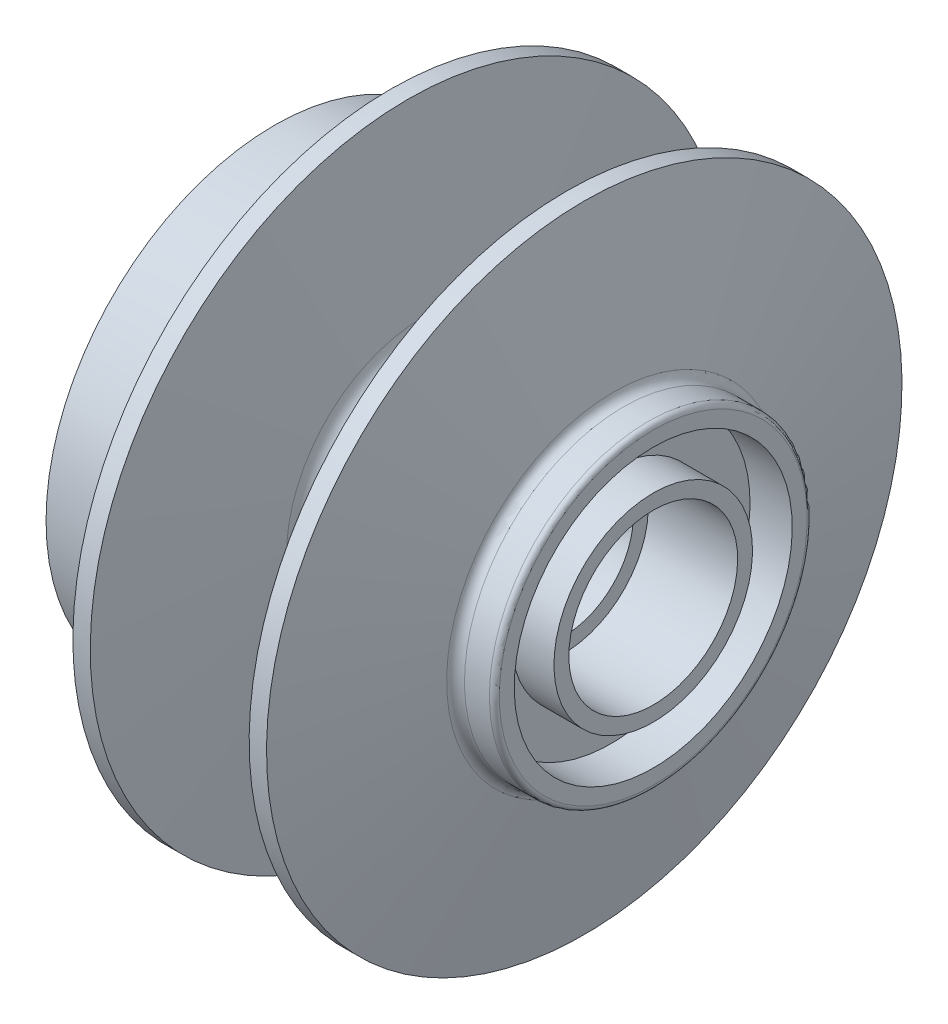
ISO-10303-21;
HEADER;
FILE_DESCRIPTION(('STEP AP214'),'2;1');
FILE_NAME('part.step','',(''),(''),'','','');
FILE_SCHEMA(('AUTOMOTIVE_DESIGN { 1 0 10303 214 1 1 1 1 }'));
ENDSEC;
DATA;
#1=APPLICATION_CONTEXT('core data for automotive mechanical design processes');
#2=APPLICATION_PROTOCOL_DEFINITION('international standard','automotive_design',2000,#1);
#3=PRODUCT_CONTEXT('',#1,'mechanical');
#4=PRODUCT('Part','Part','',(#3));
#5=PRODUCT_RELATED_PRODUCT_CATEGORY('part','',(#4));
#6=PRODUCT_DEFINITION_FORMATION('','',#4);
#7=PRODUCT_DEFINITION_CONTEXT('part definition',#1,'design');
#8=PRODUCT_DEFINITION('design','',#6,#7);
#9=PRODUCT_DEFINITION_SHAPE('','',#8);
#10=(LENGTH_UNIT() NAMED_UNIT(*) SI_UNIT(.MILLI.,.METRE.));
#11=(NAMED_UNIT(*) PLANE_ANGLE_UNIT() SI_UNIT($,.RADIAN.));
#12=(NAMED_UNIT(*) SI_UNIT($,.STERADIAN.) SOLID_ANGLE_UNIT());
#13=UNCERTAINTY_MEASURE_WITH_UNIT(LENGTH_MEASURE(1.E-05),#10,'distance_accuracy_value','');
#14=(GEOMETRIC_REPRESENTATION_CONTEXT(3) GLOBAL_UNCERTAINTY_ASSIGNED_CONTEXT((#13)) GLOBAL_UNIT_ASSIGNED_CONTEXT((#10,
#11,#12)) REPRESENTATION_CONTEXT('',''));
#15=CARTESIAN_POINT('',(0.,0.,0.));
#16=DIRECTION('',(0.,0.,1.));
#17=DIRECTION('',(1.,0.,0.));
#18=AXIS2_PLACEMENT_3D('',#15,#16,#17);
#19=CARTESIAN_POINT('',(-40.4899325555915,0.,0.));
#20=DIRECTION('',(1.,0.,0.));
#21=DIRECTION('',(0.,1.,0.));
#22=AXIS2_PLACEMENT_3D('',#19,#20,#21);
#23=PLANE('',#22);
#24=CARTESIAN_POINT('',(-40.4899325555915,0.,0.));
#25=DIRECTION('',(1.,0.,0.));
#26=DIRECTION('',(0.,1.,0.));
#27=AXIS2_PLACEMENT_3D('',#24,#25,#26);
#28=CIRCLE('',#27,46.);
#29=CARTESIAN_POINT('',(-40.4899325555915,46.,0.));
#30=VERTEX_POINT('',#29);
#31=EDGE_CURVE('E201',#30,#30,#28,.T.);
#32=ORIENTED_EDGE('',*,*,#31,.F.);
#33=EDGE_LOOP('',(#32));
#34=FACE_BOUND('',#33,.T.);
#35=CARTESIAN_POINT('',(-40.4899325555915,0.,0.));
#36=DIRECTION('',(1.,0.,0.));
#37=DIRECTION('',(0.,1.,0.));
#38=AXIS2_PLACEMENT_3D('',#35,#36,#37);
#39=CIRCLE('',#38,28.);
#40=CARTESIAN_POINT('',(-40.4899325555915,28.,0.));
#41=VERTEX_POINT('',#40);
#42=EDGE_CURVE('E198',#41,#41,#39,.T.);
#43=ORIENTED_EDGE('',*,*,#42,.T.);
#44=EDGE_LOOP('',(#43));
#45=FACE_BOUND('',#44,.T.);
#46=CARTESIAN_POINT('',(-40.4899325555915,0.,0.));
#47=DIRECTION('',(1.,0.,0.));
#48=DIRECTION('',(0.,-1.,0.));
#49=AXIS2_PLACEMENT_3D('',#46,#47,#48);
#50=CIRCLE('',#49,32.5);
#51=CARTESIAN_POINT('',(-40.4899325555915,9.86067604831289,-30.9680007083155));
#52=VERTEX_POINT('',#51);
#53=CARTESIAN_POINT('',(-40.4899325555915,30.9680007083146,-9.86067604831579));
#54=VERTEX_POINT('',#53);
#55=EDGE_CURVE('E143',#52,#54,#50,.T.);
#56=ORIENTED_EDGE('',*,*,#55,.F.);
#57=CARTESIAN_POINT('',(-40.4899325555915,11.3777031326687,-35.7323085095948));
#58=DIRECTION('',(-1.,0.,0.));
#59=DIRECTION('',(0.,1.,0.));
#60=AXIS2_PLACEMENT_3D('',#57,#58,#59);
#61=CIRCLE('',#60,5.);
#62=CARTESIAN_POINT('',(-40.4899325555915,6.45366436760765,-36.6005493979294));
#63=VERTEX_POINT('',#62);
#64=EDGE_CURVE('E57',#63,#52,#61,.T.);
#65=ORIENTED_EDGE('',*,*,#64,.F.);
#66=DIRECTION('',(0.,-0.173648177666922,0.984807753012209));
#67=VECTOR('',#66,1.);
#68=CARTESIAN_POINT('',(-40.4899325555915,6.79873891689387,-38.5575644157092));
#69=LINE('',#68,#67);
#70=CARTESIAN_POINT('',(-40.4899325555915,6.79873891689389,-38.5575644157093));
#71=VERTEX_POINT('',#70);
#72=EDGE_CURVE('E158',#71,#63,#69,.T.);
#73=ORIENTED_EDGE('',*,*,#72,.F.);
#74=CARTESIAN_POINT('',(-40.4899325555915,9.86067604831287,-42.7438898143476));
#75=DIRECTION('',(1.,0.,0.));
#76=DIRECTION('',(0.,-1.,0.));
#77=AXIS2_PLACEMENT_3D('',#74,#75,#76);
#78=CIRCLE('',#77,5.18659612270384);
#79=CARTESIAN_POINT('',(-40.4899325555915,15.0367321981317,-42.4134021837634));
#80=VERTEX_POINT('',#79);
#81=EDGE_CURVE('E156',#80,#71,#78,.T.);
#82=ORIENTED_EDGE('',*,*,#81,.F.);
#83=CARTESIAN_POINT('',(-40.4899325555915,0.,0.));
#84=DIRECTION('',(-1.,0.,0.));
#85=DIRECTION('',(0.,-1.,0.));
#86=AXIS2_PLACEMENT_3D('',#83,#84,#85);
#87=CIRCLE('',#86,45.);
#88=CARTESIAN_POINT('',(-40.4899325555915,42.4134021837633,-15.0367321981318));
#89=VERTEX_POINT('',#88);
#90=EDGE_CURVE('E117',#89,#80,#87,.T.);
#91=ORIENTED_EDGE('',*,*,#90,.F.);
#92=CARTESIAN_POINT('',(-40.4899325555915,42.7438898143494,-9.86067604831314));
#93=DIRECTION('',(1.,0.,0.));
#94=DIRECTION('',(0.,1.,0.));
#95=AXIS2_PLACEMENT_3D('',#92,#93,#94);
#96=CIRCLE('',#95,5.18659612270383);
#97=CARTESIAN_POINT('',(-40.4899325555915,38.5575644157086,-6.79873891689751));
#98=VERTEX_POINT('',#97);
#99=EDGE_CURVE('E152',#98,#89,#96,.T.);
#100=ORIENTED_EDGE('',*,*,#99,.F.);
#101=DIRECTION('',(0.,0.984807753012193,-0.173648177667016));
#102=VECTOR('',#101,1.);
#103=CARTESIAN_POINT('',(-40.4899325555915,38.5575644157086,-6.79873891689751));
#104=LINE('',#103,#102);
#105=CARTESIAN_POINT('',(-40.4899325555915,36.6005493979288,-6.4536643676111));
#106=VERTEX_POINT('',#105);
#107=EDGE_CURVE('E149',#106,#98,#104,.T.);
#108=ORIENTED_EDGE('',*,*,#107,.F.);
#109=CARTESIAN_POINT('',(-40.4899325555915,35.7323085095937,-11.3777031326721));
#110=DIRECTION('',(-1.,0.,0.));
#111=DIRECTION('',(0.,-1.,0.));
#112=AXIS2_PLACEMENT_3D('',#109,#110,#111);
#113=CIRCLE('',#112,5.);
#114=EDGE_CURVE('E146',#54,#106,#113,.T.);
#115=ORIENTED_EDGE('',*,*,#114,.F.);
#116=EDGE_LOOP('',(#56,#65,#73,#82,#91,#100,#108,#115));
#117=FACE_BOUND('',#116,.T.);
#118=ADVANCED_FACE('F42',(#34,#45,#117),#23,.F.);
#119=CARTESIAN_POINT('',(-4.68993255559153,0.,0.));
#120=DIRECTION('',(1.,0.,0.));
#121=DIRECTION('',(0.,1.,0.));
#122=AXIS2_PLACEMENT_3D('',#119,#120,#121);
#123=TOROIDAL_SURFACE('',#122,13.5,0.499999999999999);
#124=CARTESIAN_POINT('',(-4.68993255559153,0.,0.));
#125=DIRECTION('',(1.,0.,0.));
#126=DIRECTION('',(0.,1.,0.));
#127=AXIS2_PLACEMENT_3D('',#124,#125,#126);
#128=CIRCLE('',#127,14.);
#129=CARTESIAN_POINT('',(-4.68993255559153,14.,0.));
#130=VERTEX_POINT('',#129);
#131=EDGE_CURVE('E162',#130,#130,#128,.T.);
#132=ORIENTED_EDGE('',*,*,#131,.F.);
#133=EDGE_LOOP('',(#132));
#134=FACE_BOUND('',#133,.T.);
#135=CARTESIAN_POINT('',(-4.18993255559152,0.,0.));
#136=DIRECTION('',(1.,0.,0.));
#137=DIRECTION('',(0.,1.,0.));
#138=AXIS2_PLACEMENT_3D('',#135,#136,#137);
#139=CIRCLE('',#138,13.5);
#140=CARTESIAN_POINT('',(-4.18993255559153,13.5,0.));
#141=VERTEX_POINT('',#140);
#142=EDGE_CURVE('E11',#141,#141,#139,.T.);
#143=ORIENTED_EDGE('',*,*,#142,.T.);
#144=EDGE_LOOP('',(#143));
#145=FACE_BOUND('',#144,.T.);
#146=ADVANCED_FACE('F44',(#134,#145),#123,.F.);
#147=CARTESIAN_POINT('',(-4.18993255559153,0.,0.));
#148=DIRECTION('',(1.,0.,0.));
#149=DIRECTION('',(0.,1.,0.));
#150=AXIS2_PLACEMENT_3D('',#147,#148,#149);
#151=PLANE('',#150);
#152=ORIENTED_EDGE('',*,*,#142,.F.);
#153=EDGE_LOOP('',(#152));
#154=FACE_BOUND('',#153,.T.);
#155=CARTESIAN_POINT('',(-4.18993255559152,0.,0.));
#156=DIRECTION('',(1.,0.,0.));
#157=DIRECTION('',(0.,1.,0.));
#158=AXIS2_PLACEMENT_3D('',#155,#156,#157);
#159=CIRCLE('',#158,10.);
#160=CARTESIAN_POINT('',(-4.18993255559153,10.,0.));
#161=VERTEX_POINT('',#160);
#162=EDGE_CURVE('E50',#161,#161,#159,.T.);
#163=ORIENTED_EDGE('',*,*,#162,.T.);
#164=EDGE_LOOP('',(#163));
#165=FACE_BOUND('',#164,.T.);
#166=ADVANCED_FACE('F278',(#154,#165),#151,.F.);
#167=CARTESIAN_POINT('',(62.091155106443,0.,0.));
#168=DIRECTION('',(1.,0.,0.));
#169=DIRECTION('',(0.,1.,0.));
#170=AXIS2_PLACEMENT_3D('',#167,#168,#169);
#171=CYLINDRICAL_SURFACE('',#170,10.);
#172=CARTESIAN_POINT('',(-3.18993255559152,0.,0.));
#173=DIRECTION('',(1.,0.,0.));
#174=DIRECTION('',(0.,1.,0.));
#175=AXIS2_PLACEMENT_3D('',#172,#173,#174);
#176=CIRCLE('',#175,10.);
#177=CARTESIAN_POINT('',(-3.18993255559153,10.,0.));
#178=VERTEX_POINT('',#177);
#179=EDGE_CURVE('E273',#178,#178,#176,.T.);
#180=ORIENTED_EDGE('',*,*,#179,.T.);
#181=EDGE_LOOP('',(#180));
#182=FACE_BOUND('',#181,.T.);
#183=ORIENTED_EDGE('',*,*,#162,.F.);
#184=EDGE_LOOP('',(#183));
#185=FACE_BOUND('',#184,.T.);
#186=ADVANCED_FACE('F280',(#182,#185),#171,.F.);
#187=CARTESIAN_POINT('',(-3.18993255559152,0.,0.));
#188=DIRECTION('',(1.,0.,0.));
#189=DIRECTION('',(0.,1.,0.));
#190=AXIS2_PLACEMENT_3D('',#187,#188,#189);
#191=PLANE('',#190);
#192=CARTESIAN_POINT('',(-3.18993255559152,0.,0.));
#193=DIRECTION('',(1.,0.,0.));
#194=DIRECTION('',(0.,1.,0.));
#195=AXIS2_PLACEMENT_3D('',#192,#193,#194);
#196=CIRCLE('',#195,13.5);
#197=CARTESIAN_POINT('',(-3.18993255559153,13.5,0.));
#198=VERTEX_POINT('',#197);
#199=EDGE_CURVE('E270',#198,#198,#196,.T.);
#200=ORIENTED_EDGE('',*,*,#199,.T.);
#201=EDGE_LOOP('',(#200));
#202=FACE_BOUND('',#201,.T.);
#203=ORIENTED_EDGE('',*,*,#179,.F.);
#204=EDGE_LOOP('',(#203));
#205=FACE_BOUND('',#204,.T.);
#206=ADVANCED_FACE('F282',(#202,#205),#191,.T.);
#207=CARTESIAN_POINT('',(-2.68993255559152,0.,0.));
#208=DIRECTION('',(1.,0.,0.));
#209=DIRECTION('',(0.,1.,0.));
#210=AXIS2_PLACEMENT_3D('',#207,#208,#209);
#211=TOROIDAL_SURFACE('',#210,13.5,0.5);
#212=ORIENTED_EDGE('',*,*,#199,.F.);
#213=EDGE_LOOP('',(#212));
#214=FACE_BOUND('',#213,.T.);
#215=CARTESIAN_POINT('',(-2.68993255559152,0.,0.));
#216=DIRECTION('',(1.,0.,0.));
#217=DIRECTION('',(0.,1.,0.));
#218=AXIS2_PLACEMENT_3D('',#215,#216,#217);
#219=CIRCLE('',#218,14.);
#220=CARTESIAN_POINT('',(-2.68993255559153,14.,0.));
#221=VERTEX_POINT('',#220);
#222=EDGE_CURVE('E267',#221,#221,#219,.T.);
#223=ORIENTED_EDGE('',*,*,#222,.T.);
#224=EDGE_LOOP('',(#223));
#225=FACE_BOUND('',#224,.T.);
#226=ADVANCED_FACE('F289',(#214,#225),#211,.F.);
#227=CARTESIAN_POINT('',(62.091155106443,0.,0.));
#228=DIRECTION('',(1.,0.,0.));
#229=DIRECTION('',(0.,1.,0.));
#230=AXIS2_PLACEMENT_3D('',#227,#228,#229);
#231=CYLINDRICAL_SURFACE('',#230,14.);
#232=CARTESIAN_POINT('',(17.8100674444085,0.,0.));
#233=DIRECTION('',(1.,0.,0.));
#234=DIRECTION('',(0.,1.,0.));
#235=AXIS2_PLACEMENT_3D('',#232,#233,#234);
#236=CIRCLE('',#235,14.);
#237=CARTESIAN_POINT('',(17.8100674444085,14.,0.));
#238=VERTEX_POINT('',#237);
#239=EDGE_CURVE('E264',#238,#238,#236,.T.);
#240=ORIENTED_EDGE('',*,*,#239,.T.);
#241=EDGE_LOOP('',(#240));
#242=FACE_BOUND('',#241,.T.);
#243=ORIENTED_EDGE('',*,*,#222,.F.);
#244=EDGE_LOOP('',(#243));
#245=FACE_BOUND('',#244,.T.);
#246=ADVANCED_FACE('F391',(#242,#245),#231,.F.);
#247=CARTESIAN_POINT('',(17.8100674444085,0.,0.));
#248=DIRECTION('',(1.,0.,0.));
#249=DIRECTION('',(0.,1.,0.));
#250=AXIS2_PLACEMENT_3D('',#247,#248,#249);
#251=PLANE('',#250);
#252=CARTESIAN_POINT('',(17.8100674444085,0.,0.));
#253=DIRECTION('',(1.,0.,0.));
#254=DIRECTION('',(0.,1.,0.));
#255=AXIS2_PLACEMENT_3D('',#252,#253,#254);
#256=CIRCLE('',#255,17.);
#257=CARTESIAN_POINT('',(17.8100674444085,17.,0.));
#258=VERTEX_POINT('',#257);
#259=EDGE_CURVE('E261',#258,#258,#256,.T.);
#260=ORIENTED_EDGE('',*,*,#259,.T.);
#261=EDGE_LOOP('',(#260));
#262=FACE_BOUND('',#261,.T.);
#263=ORIENTED_EDGE('',*,*,#239,.F.);
#264=EDGE_LOOP('',(#263));
#265=FACE_BOUND('',#264,.T.);
#266=ADVANCED_FACE('F387',(#262,#265),#251,.T.);
#267=CARTESIAN_POINT('',(62.091155106443,0.,0.));
#268=DIRECTION('',(1.,0.,0.));
#269=DIRECTION('',(0.,1.,0.));
#270=AXIS2_PLACEMENT_3D('',#267,#268,#269);
#271=CYLINDRICAL_SURFACE('',#270,17.);
#272=CARTESIAN_POINT('',(35.8100674444085,0.,0.));
#273=DIRECTION('',(1.,0.,0.));
#274=DIRECTION('',(0.,1.,0.));
#275=AXIS2_PLACEMENT_3D('',#272,#273,#274);
#276=CIRCLE('',#275,17.);
#277=CARTESIAN_POINT('',(35.8100674444085,17.,0.));
#278=VERTEX_POINT('',#277);
#279=EDGE_CURVE('E258',#278,#278,#276,.T.);
#280=ORIENTED_EDGE('',*,*,#279,.T.);
#281=EDGE_LOOP('',(#280));
#282=FACE_BOUND('',#281,.T.);
#283=ORIENTED_EDGE('',*,*,#259,.F.);
#284=EDGE_LOOP('',(#283));
#285=FACE_BOUND('',#284,.T.);
#286=ADVANCED_FACE('F383',(#282,#285),#271,.F.);
#287=CARTESIAN_POINT('',(35.8100674444085,0.,0.));
#288=DIRECTION('',(-1.,0.,0.));
#289=DIRECTION('',(0.,-1.,0.));
#290=AXIS2_PLACEMENT_3D('',#287,#288,#289);
#291=PLANE('',#290);
#292=ORIENTED_EDGE('',*,*,#279,.F.);
#293=EDGE_LOOP('',(#292));
#294=FACE_BOUND('',#293,.T.);
#295=CARTESIAN_POINT('',(35.8100674444085,0.,0.));
#296=DIRECTION('',(1.,0.,0.));
#297=DIRECTION('',(0.,1.,0.));
#298=AXIS2_PLACEMENT_3D('',#295,#296,#297);
#299=CIRCLE('',#298,20.);
#300=CARTESIAN_POINT('',(35.8100674444085,20.,0.));
#301=VERTEX_POINT('',#300);
#302=EDGE_CURVE('E255',#301,#301,#299,.T.);
#303=ORIENTED_EDGE('',*,*,#302,.T.);
#304=EDGE_LOOP('',(#303));
#305=FACE_BOUND('',#304,.T.);
#306=ADVANCED_FACE('F379',(#294,#305),#291,.F.);
#307=CARTESIAN_POINT('',(62.091155106443,0.,0.));
#308=DIRECTION('',(1.,0.,0.));
#309=DIRECTION('',(0.,1.,0.));
#310=AXIS2_PLACEMENT_3D('',#307,#308,#309);
#311=CYLINDRICAL_SURFACE('',#310,20.);
#312=ORIENTED_EDGE('',*,*,#302,.F.);
#313=EDGE_LOOP('',(#312));
#314=FACE_BOUND('',#313,.T.);
#315=CARTESIAN_POINT('',(27.3100674444085,0.,0.));
#316=DIRECTION('',(1.,0.,0.));
#317=DIRECTION('',(0.,1.,0.));
#318=AXIS2_PLACEMENT_3D('',#315,#316,#317);
#319=CIRCLE('',#318,20.);
#320=CARTESIAN_POINT('',(27.3100674444085,20.,0.));
#321=VERTEX_POINT('',#320);
#322=EDGE_CURVE('E252',#321,#321,#319,.T.);
#323=ORIENTED_EDGE('',*,*,#322,.T.);
#324=EDGE_LOOP('',(#323));
#325=FACE_BOUND('',#324,.T.);
#326=ADVANCED_FACE('F375',(#314,#325),#311,.T.);
#327=CARTESIAN_POINT('',(27.3100674444085,0.,0.));
#328=DIRECTION('',(-1.,0.,0.));
#329=DIRECTION('',(0.,-1.,0.));
#330=AXIS2_PLACEMENT_3D('',#327,#328,#329);
#331=PLANE('',#330);
#332=ORIENTED_EDGE('',*,*,#322,.F.);
#333=EDGE_LOOP('',(#332));
#334=FACE_BOUND('',#333,.T.);
#335=CARTESIAN_POINT('',(27.3100674444085,0.,0.));
#336=DIRECTION('',(1.,0.,0.));
#337=DIRECTION('',(0.,1.,0.));
#338=AXIS2_PLACEMENT_3D('',#335,#336,#337);
#339=CIRCLE('',#338,28.);
#340=CARTESIAN_POINT('',(27.3100674444085,28.,0.));
#341=VERTEX_POINT('',#340);
#342=EDGE_CURVE('E249',#341,#341,#339,.T.);
#343=ORIENTED_EDGE('',*,*,#342,.T.);
#344=EDGE_LOOP('',(#343));
#345=FACE_BOUND('',#344,.T.);
#346=ADVANCED_FACE('F371',(#334,#345),#331,.F.);
#347=CARTESIAN_POINT('',(62.091155106443,0.,0.));
#348=DIRECTION('',(1.,0.,0.));
#349=DIRECTION('',(0.,1.,0.));
#350=AXIS2_PLACEMENT_3D('',#347,#348,#349);
#351=CYLINDRICAL_SURFACE('',#350,28.);
#352=ORIENTED_EDGE('',*,*,#342,.F.);
#353=EDGE_LOOP('',(#352));
#354=FACE_BOUND('',#353,.T.);
#355=CARTESIAN_POINT('',(35.8100674444085,0.,0.));
#356=DIRECTION('',(1.,0.,0.));
#357=DIRECTION('',(0.,1.,0.));
#358=AXIS2_PLACEMENT_3D('',#355,#356,#357);
#359=CIRCLE('',#358,28.);
#360=CARTESIAN_POINT('',(35.8100674444085,28.,0.));
#361=VERTEX_POINT('',#360);
#362=EDGE_CURVE('E246',#361,#361,#359,.T.);
#363=ORIENTED_EDGE('',*,*,#362,.T.);
#364=EDGE_LOOP('',(#363));
#365=FACE_BOUND('',#364,.T.);
#366=ADVANCED_FACE('F367',(#354,#365),#351,.F.);
#367=CARTESIAN_POINT('',(35.8100674444085,0.,0.));
#368=DIRECTION('',(-1.,0.,0.));
#369=DIRECTION('',(0.,-1.,0.));
#370=AXIS2_PLACEMENT_3D('',#367,#368,#369);
#371=PLANE('',#370);
#372=ORIENTED_EDGE('',*,*,#362,.F.);
#373=EDGE_LOOP('',(#372));
#374=FACE_BOUND('',#373,.T.);
#375=CARTESIAN_POINT('',(35.8100674444085,0.,0.));
#376=DIRECTION('',(1.,0.,0.));
#377=DIRECTION('',(0.,1.,0.));
#378=AXIS2_PLACEMENT_3D('',#375,#376,#377);
#379=CIRCLE('',#378,31.);
#380=CARTESIAN_POINT('',(35.8100674444085,31.,0.));
#381=VERTEX_POINT('',#380);
#382=EDGE_CURVE('E243',#381,#381,#379,.T.);
#383=ORIENTED_EDGE('',*,*,#382,.T.);
#384=EDGE_LOOP('',(#383));
#385=FACE_BOUND('',#384,.T.);
#386=ADVANCED_FACE('F363',(#374,#385),#371,.F.);
#387=CARTESIAN_POINT('',(34.8100674444085,0.,0.));
#388=DIRECTION('',(1.,0.,0.));
#389=DIRECTION('',(0.,1.,0.));
#390=AXIS2_PLACEMENT_3D('',#387,#388,#389);
#391=TOROIDAL_SURFACE('',#390,31.,1.);
#392=CARTESIAN_POINT('',(34.8100674444085,0.,0.));
#393=DIRECTION('',(1.,0.,0.));
#394=DIRECTION('',(0.,1.,0.));
#395=AXIS2_PLACEMENT_3D('',#392,#393,#394);
#396=CIRCLE('',#395,32.);
#397=CARTESIAN_POINT('',(34.8100674444085,32.,0.));
#398=VERTEX_POINT('',#397);
#399=EDGE_CURVE('E240',#398,#398,#396,.T.);
#400=ORIENTED_EDGE('',*,*,#399,.T.);
#401=EDGE_LOOP('',(#400));
#402=FACE_BOUND('',#401,.T.);
#403=ORIENTED_EDGE('',*,*,#382,.F.);
#404=EDGE_LOOP('',(#403));
#405=FACE_BOUND('',#404,.T.);
#406=ADVANCED_FACE('F359',(#402,#405),#391,.T.);
#407=CARTESIAN_POINT('',(62.091155106443,0.,0.));
#408=DIRECTION('',(1.,0.,0.));
#409=DIRECTION('',(0.,1.,0.));
#410=AXIS2_PLACEMENT_3D('',#407,#408,#409);
#411=CYLINDRICAL_SURFACE('',#410,32.);
#412=ORIENTED_EDGE('',*,*,#399,.F.);
#413=EDGE_LOOP('',(#412));
#414=FACE_BOUND('',#413,.T.);
#415=CARTESIAN_POINT('',(29.7853121945148,0.,0.));
#416=DIRECTION('',(1.,0.,0.));
#417=DIRECTION('',(0.,1.,0.));
#418=AXIS2_PLACEMENT_3D('',#415,#416,#417);
#419=CIRCLE('',#418,32.);
#420=CARTESIAN_POINT('',(29.7853121945147,32.,0.));
#421=VERTEX_POINT('',#420);
#422=EDGE_CURVE('E237',#421,#421,#419,.T.);
#423=ORIENTED_EDGE('',*,*,#422,.T.);
#424=EDGE_LOOP('',(#423));
#425=FACE_BOUND('',#424,.T.);
#426=ADVANCED_FACE('F355',(#414,#425),#411,.T.);
#427=CARTESIAN_POINT('',(29.7853121945148,0.,0.));
#428=DIRECTION('',(1.,0.,0.));
#429=DIRECTION('',(0.,1.,0.));
#430=AXIS2_PLACEMENT_3D('',#427,#428,#429);
#431=TOROIDAL_SURFACE('',#430,34.,2.);
#432=CARTESIAN_POINT('',(27.8220578276194,0.,0.));
#433=DIRECTION('',(1.,0.,0.));
#434=DIRECTION('',(0.,1.,0.));
#435=AXIS2_PLACEMENT_3D('',#432,#433,#434);
#436=CIRCLE('',#435,33.618382009247);
#437=CARTESIAN_POINT('',(27.8220578276194,33.618382009247,0.));
#438=VERTEX_POINT('',#437);
#439=EDGE_CURVE('E234',#438,#438,#436,.T.);
#440=ORIENTED_EDGE('',*,*,#439,.T.);
#441=EDGE_LOOP('',(#440));
#442=FACE_BOUND('',#441,.T.);
#443=ORIENTED_EDGE('',*,*,#422,.F.);
#444=EDGE_LOOP('',(#443));
#445=FACE_BOUND('',#444,.T.);
#446=ADVANCED_FACE('F351',(#442,#445),#431,.F.);
#447=CARTESIAN_POINT('',(21.9164695304729,0.,0.));
#448=DIRECTION('',(-1.,0.,0.));
#449=DIRECTION('',(0.,-1.,0.));
#450=AXIS2_PLACEMENT_3D('',#447,#448,#449);
#451=CONICAL_SURFACE('',#450,64.,1.37881010907552);
#452=ORIENTED_EDGE('',*,*,#439,.F.);
#453=EDGE_LOOP('',(#452));
#454=FACE_BOUND('',#453,.T.);
#455=CARTESIAN_POINT('',(21.9164695304729,0.,0.));
#456=DIRECTION('',(1.,0.,0.));
#457=DIRECTION('',(0.,1.,0.));
#458=AXIS2_PLACEMENT_3D('',#455,#456,#457);
#459=CIRCLE('',#458,64.);
#460=CARTESIAN_POINT('',(21.9164695304729,64.,0.));
#461=VERTEX_POINT('',#460);
#462=EDGE_CURVE('E231',#461,#461,#459,.T.);
#463=ORIENTED_EDGE('',*,*,#462,.T.);
#464=EDGE_LOOP('',(#463));
#465=FACE_BOUND('',#464,.T.);
#466=ADVANCED_FACE('F347',(#454,#465),#451,.T.);
#467=CARTESIAN_POINT('',(62.091155106443,0.,0.));
#468=DIRECTION('',(1.,0.,0.));
#469=DIRECTION('',(0.,1.,0.));
#470=AXIS2_PLACEMENT_3D('',#467,#468,#469);
#471=CYLINDRICAL_SURFACE('',#470,64.);
#472=ORIENTED_EDGE('',*,*,#462,.F.);
#473=EDGE_LOOP('',(#472));
#474=FACE_BOUND('',#473,.T.);
#475=CARTESIAN_POINT('',(18.4164695304729,0.,0.));
#476=DIRECTION('',(1.,0.,0.));
#477=DIRECTION('',(0.,1.,0.));
#478=AXIS2_PLACEMENT_3D('',#475,#476,#477);
#479=CIRCLE('',#478,64.);
#480=CARTESIAN_POINT('',(18.4164695304729,64.,0.));
#481=VERTEX_POINT('',#480);
#482=EDGE_CURVE('E228',#481,#481,#479,.T.);
#483=ORIENTED_EDGE('',*,*,#482,.T.);
#484=EDGE_LOOP('',(#483));
#485=FACE_BOUND('',#484,.T.);
#486=ADVANCED_FACE('F343',(#474,#485),#471,.T.);
#487=CARTESIAN_POINT('',(15.2363770857334,0.,0.));
#488=DIRECTION('',(1.,0.,0.));
#489=DIRECTION('',(0.,1.,0.));
#490=AXIS2_PLACEMENT_3D('',#487,#488,#489);
#491=CONICAL_SURFACE('',#490,27.6513770290094,1.48352986419518);
#492=ORIENTED_EDGE('',*,*,#482,.F.);
#493=EDGE_LOOP('',(#492));
#494=FACE_BOUND('',#493,.T.);
#495=CARTESIAN_POINT('',(15.2363770857334,0.,0.));
#496=DIRECTION('',(1.,0.,0.));
#497=DIRECTION('',(0.,1.,0.));
#498=AXIS2_PLACEMENT_3D('',#495,#496,#497);
#499=CIRCLE('',#498,27.6513770290094);
#500=CARTESIAN_POINT('',(15.2363770857334,27.6513770290094,0.));
#501=VERTEX_POINT('',#500);
#502=EDGE_CURVE('E225',#501,#501,#499,.T.);
#503=ORIENTED_EDGE('',*,*,#502,.T.);
#504=EDGE_LOOP('',(#503));
#505=FACE_BOUND('',#504,.T.);
#506=ADVANCED_FACE('F339',(#494,#505),#491,.T.);
#507=CARTESIAN_POINT('',(11.2515982933664,0.,0.));
#508=DIRECTION('',(1.,0.,0.));
#509=DIRECTION('',(0.,1.,0.));
#510=AXIS2_PLACEMENT_3D('',#507,#508,#509);
#511=TOROIDAL_SURFACE('',#510,28.,4.);
#512=ORIENTED_EDGE('',*,*,#502,.F.);
#513=EDGE_LOOP('',(#512));
#514=FACE_BOUND('',#513,.T.);
#515=CARTESIAN_POINT('',(11.2515982933664,0.,0.));
#516=DIRECTION('',(1.,0.,0.));
#517=DIRECTION('',(0.,1.,0.));
#518=AXIS2_PLACEMENT_3D('',#515,#516,#517);
#519=CIRCLE('',#518,24.);
#520=CARTESIAN_POINT('',(11.2515982933664,24.,0.));
#521=VERTEX_POINT('',#520);
#522=EDGE_CURVE('E222',#521,#521,#519,.T.);
#523=ORIENTED_EDGE('',*,*,#522,.T.);
#524=EDGE_LOOP('',(#523));
#525=FACE_BOUND('',#524,.T.);
#526=ADVANCED_FACE('F335',(#514,#525),#511,.F.);
#527=CARTESIAN_POINT('',(62.091155106443,0.,0.));
#528=DIRECTION('',(1.,0.,0.));
#529=DIRECTION('',(0.,1.,0.));
#530=AXIS2_PLACEMENT_3D('',#527,#528,#529);
#531=CYLINDRICAL_SURFACE('',#530,24.);
#532=ORIENTED_EDGE('',*,*,#522,.F.);
#533=EDGE_LOOP('',(#532));
#534=FACE_BOUND('',#533,.T.);
#535=CARTESIAN_POINT('',(-6.41865923242059,0.,0.));
#536=DIRECTION('',(1.,0.,0.));
#537=DIRECTION('',(0.,1.,0.));
#538=AXIS2_PLACEMENT_3D('',#535,#536,#537);
#539=CIRCLE('',#538,24.);
#540=CARTESIAN_POINT('',(-6.41865923242059,24.,0.));
#541=VERTEX_POINT('',#540);
#542=EDGE_CURVE('E219',#541,#541,#539,.T.);
#543=ORIENTED_EDGE('',*,*,#542,.T.);
#544=EDGE_LOOP('',(#543));
#545=FACE_BOUND('',#544,.T.);
#546=ADVANCED_FACE('F331',(#534,#545),#531,.T.);
#547=CARTESIAN_POINT('',(-6.41865923242059,0.,0.));
#548=DIRECTION('',(1.,0.,0.));
#549=DIRECTION('',(0.,1.,0.));
#550=AXIS2_PLACEMENT_3D('',#547,#548,#549);
#551=TOROIDAL_SURFACE('',#550,28.,4.);
#552=CARTESIAN_POINT('',(-10.4034380247876,0.,0.));
#553=DIRECTION('',(1.,0.,0.));
#554=DIRECTION('',(0.,1.,0.));
#555=AXIS2_PLACEMENT_3D('',#552,#553,#554);
#556=CIRCLE('',#555,27.6513770290094);
#557=CARTESIAN_POINT('',(-10.4034380247876,27.6513770290094,0.));
#558=VERTEX_POINT('',#557);
#559=EDGE_CURVE('E216',#558,#558,#556,.T.);
#560=ORIENTED_EDGE('',*,*,#559,.T.);
#561=EDGE_LOOP('',(#560));
#562=FACE_BOUND('',#561,.T.);
#563=ORIENTED_EDGE('',*,*,#542,.F.);
#564=EDGE_LOOP('',(#563));
#565=FACE_BOUND('',#564,.T.);
#566=ADVANCED_FACE('F327',(#562,#565),#551,.F.);
#567=CARTESIAN_POINT('',(-13.5835304695271,0.,0.));
#568=DIRECTION('',(-1.,0.,0.));
#569=DIRECTION('',(0.,-1.,0.));
#570=AXIS2_PLACEMENT_3D('',#567,#568,#569);
#571=CONICAL_SURFACE('',#570,64.,1.48352986419518);
#572=ORIENTED_EDGE('',*,*,#559,.F.);
#573=EDGE_LOOP('',(#572));
#574=FACE_BOUND('',#573,.T.);
#575=CARTESIAN_POINT('',(-13.5835304695271,0.,0.));
#576=DIRECTION('',(1.,0.,0.));
#577=DIRECTION('',(0.,1.,0.));
#578=AXIS2_PLACEMENT_3D('',#575,#576,#577);
#579=CIRCLE('',#578,64.);
#580=CARTESIAN_POINT('',(-13.5835304695271,64.,0.));
#581=VERTEX_POINT('',#580);
#582=EDGE_CURVE('E213',#581,#581,#579,.T.);
#583=ORIENTED_EDGE('',*,*,#582,.T.);
#584=EDGE_LOOP('',(#583));
#585=FACE_BOUND('',#584,.T.);
#586=ADVANCED_FACE('F323',(#574,#585),#571,.T.);
#587=CARTESIAN_POINT('',(62.091155106443,0.,0.));
#588=DIRECTION('',(1.,0.,0.));
#589=DIRECTION('',(0.,1.,0.));
#590=AXIS2_PLACEMENT_3D('',#587,#588,#589);
#591=CYLINDRICAL_SURFACE('',#590,64.);
#592=CARTESIAN_POINT('',(-17.0835304695271,0.,0.));
#593=DIRECTION('',(1.,0.,0.));
#594=DIRECTION('',(0.,1.,0.));
#595=AXIS2_PLACEMENT_3D('',#592,#593,#594);
#596=CIRCLE('',#595,64.);
#597=CARTESIAN_POINT('',(-17.0835304695271,64.,0.));
#598=VERTEX_POINT('',#597);
#599=EDGE_CURVE('E210',#598,#598,#596,.T.);
#600=ORIENTED_EDGE('',*,*,#599,.T.);
#601=EDGE_LOOP('',(#600));
#602=FACE_BOUND('',#601,.T.);
#603=ORIENTED_EDGE('',*,*,#582,.F.);
#604=EDGE_LOOP('',(#603));
#605=FACE_BOUND('',#604,.T.);
#606=ADVANCED_FACE('F319',(#602,#605),#591,.T.);
#607=CARTESIAN_POINT('',(-18.416800203997,0.,0.));
#608=DIRECTION('',(1.,0.,0.));
#609=DIRECTION('',(0.,1.,0.));
#610=AXIS2_PLACEMENT_3D('',#607,#608,#609);
#611=CONICAL_SURFACE('',#610,48.7606572013199,1.48352986419519);
#612=ORIENTED_EDGE('',*,*,#599,.F.);
#613=EDGE_LOOP('',(#612));
#614=FACE_BOUND('',#613,.T.);
#615=CARTESIAN_POINT('',(-18.416800203997,0.,0.));
#616=DIRECTION('',(1.,0.,0.));
#617=DIRECTION('',(0.,1.,0.));
#618=AXIS2_PLACEMENT_3D('',#615,#616,#617);
#619=CIRCLE('',#618,48.7606572013199);
#620=CARTESIAN_POINT('',(-18.416800203997,48.7606572013199,0.));
#621=VERTEX_POINT('',#620);
#622=EDGE_CURVE('E207',#621,#621,#619,.T.);
#623=ORIENTED_EDGE('',*,*,#622,.T.);
#624=EDGE_LOOP('',(#623));
#625=FACE_BOUND('',#624,.T.);
#626=ADVANCED_FACE('F315',(#614,#625),#611,.T.);
#627=CARTESIAN_POINT('',(-19.4129949020887,0.,0.));
#628=DIRECTION('',(1.,0.,0.));
#629=DIRECTION('',(0.,1.,0.));
#630=AXIS2_PLACEMENT_3D('',#627,#628,#629);
#631=TOROIDAL_SURFACE('',#630,48.8478129440676,1.);
#632=ORIENTED_EDGE('',*,*,#622,.F.);
#633=EDGE_LOOP('',(#632));
#634=FACE_BOUND('',#633,.T.);
#635=CARTESIAN_POINT('',(-19.3258391593411,0.,0.));
#636=DIRECTION('',(1.,0.,0.));
#637=DIRECTION('',(0.,1.,0.));
#638=AXIS2_PLACEMENT_3D('',#635,#636,#637);
#639=CIRCLE('',#638,47.8516182459758);
#640=CARTESIAN_POINT('',(-19.3258391593411,47.8516182459758,0.));
#641=VERTEX_POINT('',#640);
#642=EDGE_CURVE('E204',#641,#641,#639,.T.);
#643=ORIENTED_EDGE('',*,*,#642,.T.);
#644=EDGE_LOOP('',(#643));
#645=FACE_BOUND('',#644,.T.);
#646=ADVANCED_FACE('F311',(#634,#645),#631,.F.);
#647=CARTESIAN_POINT('',(-40.4899325555915,0.,0.));
#648=DIRECTION('',(1.,0.,0.));
#649=DIRECTION('',(0.,1.,0.));
#650=AXIS2_PLACEMENT_3D('',#647,#648,#649);
#651=CONICAL_SURFACE('',#650,46.,0.0872664625997169);
#652=ORIENTED_EDGE('',*,*,#642,.F.);
#653=EDGE_LOOP('',(#652));
#654=FACE_BOUND('',#653,.T.);
#655=ORIENTED_EDGE('',*,*,#31,.T.);
#656=EDGE_LOOP('',(#655));
#657=FACE_BOUND('',#656,.T.);
#658=ADVANCED_FACE('F308',(#654,#657),#651,.T.);
#659=CARTESIAN_POINT('',(62.091155106443,0.,0.));
#660=DIRECTION('',(1.,0.,0.));
#661=DIRECTION('',(0.,1.,0.));
#662=AXIS2_PLACEMENT_3D('',#659,#660,#661);
#663=CYLINDRICAL_SURFACE('',#662,28.);
#664=ORIENTED_EDGE('',*,*,#42,.F.);
#665=EDGE_LOOP('',(#664));
#666=FACE_BOUND('',#665,.T.);
#667=CARTESIAN_POINT('',(-44.4899325555915,0.,0.));
#668=DIRECTION('',(1.,0.,0.));
#669=DIRECTION('',(0.,1.,0.));
#670=AXIS2_PLACEMENT_3D('',#667,#668,#669);
#671=CIRCLE('',#670,28.);
#672=CARTESIAN_POINT('',(-44.4899325555915,28.,0.));
#673=VERTEX_POINT('',#672);
#674=EDGE_CURVE('E195',#673,#673,#671,.T.);
#675=ORIENTED_EDGE('',*,*,#674,.T.);
#676=EDGE_LOOP('',(#675));
#677=FACE_BOUND('',#676,.T.);
#678=ADVANCED_FACE('F306',(#666,#677),#663,.T.);
#679=CARTESIAN_POINT('',(-44.4899325555915,0.,0.));
#680=DIRECTION('',(1.,0.,0.));
#681=DIRECTION('',(0.,1.,0.));
#682=AXIS2_PLACEMENT_3D('',#679,#680,#681);
#683=PLANE('',#682);
#684=ORIENTED_EDGE('',*,*,#674,.F.);
#685=EDGE_LOOP('',(#684));
#686=FACE_BOUND('',#685,.T.);
#687=CARTESIAN_POINT('',(-44.4899325555915,0.,0.));
#688=DIRECTION('',(1.,0.,0.));
#689=DIRECTION('',(0.,1.,0.));
#690=AXIS2_PLACEMENT_3D('',#687,#688,#689);
#691=CIRCLE('',#690,23.);
#692=CARTESIAN_POINT('',(-44.4899325555915,23.,0.));
#693=VERTEX_POINT('',#692);
#694=EDGE_CURVE('E192',#693,#693,#691,.T.);
#695=ORIENTED_EDGE('',*,*,#694,.T.);
#696=EDGE_LOOP('',(#695));
#697=FACE_BOUND('',#696,.T.);
#698=ADVANCED_FACE('F502',(#686,#697),#683,.F.);
#699=CARTESIAN_POINT('',(-45.4899325555915,0.,0.));
#700=DIRECTION('',(1.,0.,0.));
#701=DIRECTION('',(0.,1.,0.));
#702=AXIS2_PLACEMENT_3D('',#699,#700,#701);
#703=TOROIDAL_SURFACE('',#702,23.,0.999999999999999);
#704=CARTESIAN_POINT('',(-45.4899325555915,0.,0.));
#705=DIRECTION('',(1.,0.,0.));
#706=DIRECTION('',(0.,1.,0.));
#707=AXIS2_PLACEMENT_3D('',#704,#705,#706);
#708=CIRCLE('',#707,22.);
#709=CARTESIAN_POINT('',(-45.4899325555915,22.,0.));
#710=VERTEX_POINT('',#709);
#711=EDGE_CURVE('E189',#710,#710,#708,.T.);
#712=ORIENTED_EDGE('',*,*,#711,.T.);
#713=EDGE_LOOP('',(#712));
#714=FACE_BOUND('',#713,.T.);
#715=ORIENTED_EDGE('',*,*,#694,.F.);
#716=EDGE_LOOP('',(#715));
#717=FACE_BOUND('',#716,.T.);
#718=ADVANCED_FACE('F509',(#714,#717),#703,.F.);
#719=CARTESIAN_POINT('',(62.091155106443,0.,0.));
#720=DIRECTION('',(1.,0.,0.));
#721=DIRECTION('',(0.,1.,0.));
#722=AXIS2_PLACEMENT_3D('',#719,#720,#721);
#723=CYLINDRICAL_SURFACE('',#722,22.);
#724=ORIENTED_EDGE('',*,*,#711,.F.);
#725=EDGE_LOOP('',(#724));
#726=FACE_BOUND('',#725,.T.);
#727=CARTESIAN_POINT('',(-46.1899325555915,0.,0.));
#728=DIRECTION('',(1.,0.,0.));
#729=DIRECTION('',(0.,1.,0.));
#730=AXIS2_PLACEMENT_3D('',#727,#728,#729);
#731=CIRCLE('',#730,22.);
#732=CARTESIAN_POINT('',(-46.1899325555915,22.,0.));
#733=VERTEX_POINT('',#732);
#734=EDGE_CURVE('E186',#733,#733,#731,.T.);
#735=ORIENTED_EDGE('',*,*,#734,.T.);
#736=EDGE_LOOP('',(#735));
#737=FACE_BOUND('',#736,.T.);
#738=ADVANCED_FACE('F516',(#726,#737),#723,.T.);
#739=CARTESIAN_POINT('',(-46.1899325555915,0.,0.));
#740=DIRECTION('',(1.,0.,0.));
#741=DIRECTION('',(0.,1.,0.));
#742=AXIS2_PLACEMENT_3D('',#739,#740,#741);
#743=TOROIDAL_SURFACE('',#742,20.,2.);
#744=CARTESIAN_POINT('',(-48.1899325555915,0.,0.));
#745=DIRECTION('',(1.,0.,0.));
#746=DIRECTION('',(0.,1.,0.));
#747=AXIS2_PLACEMENT_3D('',#744,#745,#746);
#748=CIRCLE('',#747,20.);
#749=CARTESIAN_POINT('',(-48.1899325555915,20.,0.));
#750=VERTEX_POINT('',#749);
#751=EDGE_CURVE('E183',#750,#750,#748,.T.);
#752=ORIENTED_EDGE('',*,*,#751,.T.);
#753=EDGE_LOOP('',(#752));
#754=FACE_BOUND('',#753,.T.);
#755=ORIENTED_EDGE('',*,*,#734,.F.);
#756=EDGE_LOOP('',(#755));
#757=FACE_BOUND('',#756,.T.);
#758=ADVANCED_FACE('F524',(#754,#757),#743,.T.);
#759=CARTESIAN_POINT('',(-48.1899325555915,0.,0.));
#760=DIRECTION('',(1.,0.,0.));
#761=DIRECTION('',(0.,1.,0.));
#762=AXIS2_PLACEMENT_3D('',#759,#760,#761);
#763=PLANE('',#762);
#764=ORIENTED_EDGE('',*,*,#751,.F.);
#765=EDGE_LOOP('',(#764));
#766=FACE_BOUND('',#765,.T.);
#767=CARTESIAN_POINT('',(-48.1899325555915,0.,0.));
#768=DIRECTION('',(1.,0.,0.));
#769=DIRECTION('',(0.,1.,0.));
#770=AXIS2_PLACEMENT_3D('',#767,#768,#769);
#771=CIRCLE('',#770,17.);
#772=CARTESIAN_POINT('',(-48.1899325555915,17.,0.));
#773=VERTEX_POINT('',#772);
#774=EDGE_CURVE('E180',#773,#773,#771,.T.);
#775=ORIENTED_EDGE('',*,*,#774,.T.);
#776=EDGE_LOOP('',(#775));
#777=FACE_BOUND('',#776,.T.);
#778=ADVANCED_FACE('F532',(#766,#777),#763,.F.);
#779=CARTESIAN_POINT('',(62.091155106443,0.,0.));
#780=DIRECTION('',(1.,0.,0.));
#781=DIRECTION('',(0.,1.,0.));
#782=AXIS2_PLACEMENT_3D('',#779,#780,#781);
#783=CYLINDRICAL_SURFACE('',#782,17.);
#784=CARTESIAN_POINT('',(-25.1899325555915,0.,0.));
#785=DIRECTION('',(1.,0.,0.));
#786=DIRECTION('',(0.,1.,0.));
#787=AXIS2_PLACEMENT_3D('',#784,#785,#786);
#788=CIRCLE('',#787,17.);
#789=CARTESIAN_POINT('',(-25.1899325555915,17.,0.));
#790=VERTEX_POINT('',#789);
#791=EDGE_CURVE('E177',#790,#790,#788,.T.);
#792=ORIENTED_EDGE('',*,*,#791,.T.);
#793=EDGE_LOOP('',(#792));
#794=FACE_BOUND('',#793,.T.);
#795=ORIENTED_EDGE('',*,*,#774,.F.);
#796=EDGE_LOOP('',(#795));
#797=FACE_BOUND('',#796,.T.);
#798=ADVANCED_FACE('F540',(#794,#797),#783,.F.);
#799=CARTESIAN_POINT('',(-25.1899325555915,0.,0.));
#800=DIRECTION('',(1.,0.,0.));
#801=DIRECTION('',(0.,1.,0.));
#802=AXIS2_PLACEMENT_3D('',#799,#800,#801);
#803=PLANE('',#802);
#804=ORIENTED_EDGE('',*,*,#791,.F.);
#805=EDGE_LOOP('',(#804));
#806=FACE_BOUND('',#805,.T.);
#807=CARTESIAN_POINT('',(-25.1899325555915,0.,0.));
#808=DIRECTION('',(1.,0.,0.));
#809=DIRECTION('',(0.,1.,0.));
#810=AXIS2_PLACEMENT_3D('',#807,#808,#809);
#811=CIRCLE('',#810,14.);
#812=CARTESIAN_POINT('',(-25.1899325555915,14.,0.));
#813=VERTEX_POINT('',#812);
#814=EDGE_CURVE('E174',#813,#813,#811,.T.);
#815=ORIENTED_EDGE('',*,*,#814,.T.);
#816=EDGE_LOOP('',(#815));
#817=FACE_BOUND('',#816,.T.);
#818=ADVANCED_FACE('F548',(#806,#817),#803,.F.);
#819=CARTESIAN_POINT('',(62.091155106443,0.,0.));
#820=DIRECTION('',(1.,0.,0.));
#821=DIRECTION('',(0.,1.,0.));
#822=AXIS2_PLACEMENT_3D('',#819,#820,#821);
#823=CYLINDRICAL_SURFACE('',#822,14.);
#824=ORIENTED_EDGE('',*,*,#131,.T.);
#825=EDGE_LOOP('',(#824));
#826=FACE_BOUND('',#825,.T.);
#827=ORIENTED_EDGE('',*,*,#814,.F.);
#828=EDGE_LOOP('',(#827));
#829=FACE_BOUND('',#828,.T.);
#830=ADVANCED_FACE('F556',(#826,#829),#823,.F.);
#831=CARTESIAN_POINT('',(-20.4899325555915,11.3777031326687,-35.7323085095948));
#832=DIRECTION('',(-1.,0.,0.));
#833=DIRECTION('',(0.,-1.,0.));
#834=AXIS2_PLACEMENT_3D('',#831,#832,#833);
#835=CYLINDRICAL_SURFACE('',#834,5.);
#836=ORIENTED_EDGE('',*,*,#64,.T.);
#837=DIRECTION('',(-1.,0.,0.));
#838=VECTOR('',#837,1.);
#839=CARTESIAN_POINT('',(-20.4899325555915,9.86067604831289,-30.9680007083155));
#840=LINE('',#839,#838);
#841=CARTESIAN_POINT('',(-20.4899325555915,9.86067604831289,-30.9680007083155));
#842=VERTEX_POINT('',#841);
#843=EDGE_CURVE('E93',#842,#52,#840,.T.);
#844=ORIENTED_EDGE('',*,*,#843,.F.);
#845=CARTESIAN_POINT('',(-20.4899325555915,11.3777031326687,-35.7323085095948));
#846=DIRECTION('',(-1.,0.,0.));
#847=DIRECTION('',(0.,1.,0.));
#848=AXIS2_PLACEMENT_3D('',#845,#846,#847);
#849=CIRCLE('',#848,5.);
#850=CARTESIAN_POINT('',(-20.4899325555915,6.45366436760765,-36.6005493979294));
#851=VERTEX_POINT('',#850);
#852=EDGE_CURVE('E160',#851,#842,#849,.T.);
#853=ORIENTED_EDGE('',*,*,#852,.F.);
#854=DIRECTION('',(-1.,0.,0.));
#855=VECTOR('',#854,1.);
#856=CARTESIAN_POINT('',(-20.4899325555915,6.45366436760765,-36.6005493979294));
#857=LINE('',#856,#855);
#858=EDGE_CURVE('E65',#851,#63,#857,.T.);
#859=ORIENTED_EDGE('',*,*,#858,.T.);
#860=EDGE_LOOP('',(#836,#844,#853,#859));
#861=FACE_BOUND('',#860,.T.);
#862=ADVANCED_FACE('F563',(#861),#835,.F.);
#863=CARTESIAN_POINT('',(-20.4899325555915,6.79873891689387,-38.5575644157092));
#864=DIRECTION('',(0.,-0.98480775301221,-0.173648177666922));
#865=DIRECTION('',(0.,0.173648177666922,-0.98480775301221));
#866=AXIS2_PLACEMENT_3D('',#863,#864,#865);
#867=PLANE('',#866);
#868=ORIENTED_EDGE('',*,*,#72,.T.);
#869=ORIENTED_EDGE('',*,*,#858,.F.);
#870=DIRECTION('',(0.,-0.173648177666922,0.984807753012209));
#871=VECTOR('',#870,1.);
#872=CARTESIAN_POINT('',(-20.4899325555915,6.79873891689387,-38.5575644157092));
#873=LINE('',#872,#871);
#874=CARTESIAN_POINT('',(-20.4899325555915,6.79873891689389,-38.5575644157093));
#875=VERTEX_POINT('',#874);
#876=EDGE_CURVE('E129',#875,#851,#873,.T.);
#877=ORIENTED_EDGE('',*,*,#876,.F.);
#878=DIRECTION('',(-1.,0.,0.));
#879=VECTOR('',#878,1.);
#880=CARTESIAN_POINT('',(-20.4899325555915,6.79873891689389,-38.5575644157093));
#881=LINE('',#880,#879);
#882=EDGE_CURVE('E121',#875,#71,#881,.T.);
#883=ORIENTED_EDGE('',*,*,#882,.T.);
#884=EDGE_LOOP('',(#868,#869,#877,#883));
#885=FACE_BOUND('',#884,.T.);
#886=ADVANCED_FACE('F576',(#885),#867,.F.);
#887=CARTESIAN_POINT('',(-20.4899325555915,9.86067604831288,-42.7438898143476));
#888=DIRECTION('',(-1.,0.,0.));
#889=DIRECTION('',(0.,-1.,0.));
#890=AXIS2_PLACEMENT_3D('',#887,#888,#889);
#891=CYLINDRICAL_SURFACE('',#890,5.18659612270384);
#892=ORIENTED_EDGE('',*,*,#81,.T.);
#893=ORIENTED_EDGE('',*,*,#882,.F.);
#894=CARTESIAN_POINT('',(-20.4899325555915,9.86067604831288,-42.7438898143476));
#895=DIRECTION('',(1.,0.,0.));
#896=DIRECTION('',(0.,-1.,0.));
#897=AXIS2_PLACEMENT_3D('',#894,#895,#896);
#898=CIRCLE('',#897,5.18659612270384);
#899=CARTESIAN_POINT('',(-20.4899325555915,15.0367321981317,-42.4134021837634));
#900=VERTEX_POINT('',#899);
#901=EDGE_CURVE('E125',#900,#875,#898,.T.);
#902=ORIENTED_EDGE('',*,*,#901,.F.);
#903=DIRECTION('',(-1.,0.,0.));
#904=VECTOR('',#903,1.);
#905=CARTESIAN_POINT('',(-20.4899325555915,15.0367321981317,-42.4134021837634));
#906=LINE('',#905,#904);
#907=EDGE_CURVE('E110',#900,#80,#906,.T.);
#908=ORIENTED_EDGE('',*,*,#907,.T.);
#909=EDGE_LOOP('',(#892,#893,#902,#908));
#910=FACE_BOUND('',#909,.T.);
#911=ADVANCED_FACE('F126',(#910),#891,.T.);
#912=CARTESIAN_POINT('',(-20.4899325555915,0.,0.));
#913=DIRECTION('',(-1.,0.,0.));
#914=DIRECTION('',(0.,-1.,0.));
#915=AXIS2_PLACEMENT_3D('',#912,#913,#914);
#916=CYLINDRICAL_SURFACE('',#915,45.);
#917=ORIENTED_EDGE('',*,*,#90,.T.);
#918=ORIENTED_EDGE('',*,*,#907,.F.);
#919=CARTESIAN_POINT('',(-20.4899325555915,0.,0.));
#920=DIRECTION('',(-1.,0.,0.));
#921=DIRECTION('',(0.,-1.,0.));
#922=AXIS2_PLACEMENT_3D('',#919,#920,#921);
#923=CIRCLE('',#922,45.);
#924=CARTESIAN_POINT('',(-20.4899325555915,42.4134021837634,-15.0367321981318));
#925=VERTEX_POINT('',#924);
#926=EDGE_CURVE('E114',#925,#900,#923,.T.);
#927=ORIENTED_EDGE('',*,*,#926,.F.);
#928=DIRECTION('',(-1.,0.,0.));
#929=VECTOR('',#928,1.);
#930=CARTESIAN_POINT('',(-20.4899325555915,42.4134021837634,-15.0367321981318));
#931=LINE('',#930,#929);
#932=EDGE_CURVE('E122',#925,#89,#931,.T.);
#933=ORIENTED_EDGE('',*,*,#932,.T.);
#934=EDGE_LOOP('',(#917,#918,#927,#933));
#935=FACE_BOUND('',#934,.T.);
#936=ADVANCED_FACE('F112',(#935),#916,.F.);
#937=CARTESIAN_POINT('',(-20.4899325555915,42.7438898143494,-9.86067604831314));
#938=DIRECTION('',(-1.,0.,0.));
#939=DIRECTION('',(0.,-1.,0.));
#940=AXIS2_PLACEMENT_3D('',#937,#938,#939);
#941=CYLINDRICAL_SURFACE('',#940,5.18659612270383);
#942=ORIENTED_EDGE('',*,*,#99,.T.);
#943=ORIENTED_EDGE('',*,*,#932,.F.);
#944=CARTESIAN_POINT('',(-20.4899325555915,42.7438898143494,-9.86067604831314));
#945=DIRECTION('',(1.,0.,0.));
#946=DIRECTION('',(0.,1.,0.));
#947=AXIS2_PLACEMENT_3D('',#944,#945,#946);
#948=CIRCLE('',#947,5.18659612270383);
#949=CARTESIAN_POINT('',(-20.4899325555915,38.5575644157086,-6.79873891689751));
#950=VERTEX_POINT('',#949);
#951=EDGE_CURVE('E135',#950,#925,#948,.T.);
#952=ORIENTED_EDGE('',*,*,#951,.F.);
#953=DIRECTION('',(-1.,0.,0.));
#954=VECTOR('',#953,1.);
#955=CARTESIAN_POINT('',(-20.4899325555915,38.5575644157086,-6.79873891689751));
#956=LINE('',#955,#954);
#957=EDGE_CURVE('E165',#950,#98,#956,.T.);
#958=ORIENTED_EDGE('',*,*,#957,.T.);
#959=EDGE_LOOP('',(#942,#943,#952,#958));
#960=FACE_BOUND('',#959,.T.);
#961=ADVANCED_FACE('F594',(#960),#941,.T.);
#962=CARTESIAN_POINT('',(-20.4899325555915,38.5575644157086,-6.79873891689751));
#963=DIRECTION('',(0.,0.173648177667016,0.984807753012193));
#964=DIRECTION('',(0.,-0.984807753012193,0.173648177667016));
#965=AXIS2_PLACEMENT_3D('',#962,#963,#964);
#966=PLANE('',#965);
#967=ORIENTED_EDGE('',*,*,#107,.T.);
#968=ORIENTED_EDGE('',*,*,#957,.F.);
#969=DIRECTION('',(0.,0.984807753012193,-0.173648177667016));
#970=VECTOR('',#969,1.);
#971=CARTESIAN_POINT('',(-20.4899325555915,38.5575644157086,-6.79873891689751));
#972=LINE('',#971,#970);
#973=CARTESIAN_POINT('',(-20.4899325555915,36.6005493979288,-6.4536643676111));
#974=VERTEX_POINT('',#973);
#975=EDGE_CURVE('E137',#974,#950,#972,.T.);
#976=ORIENTED_EDGE('',*,*,#975,.F.);
#977=DIRECTION('',(-1.,0.,0.));
#978=VECTOR('',#977,1.);
#979=CARTESIAN_POINT('',(-20.4899325555915,36.6005493979288,-6.4536643676111));
#980=LINE('',#979,#978);
#981=EDGE_CURVE('E167',#974,#106,#980,.T.);
#982=ORIENTED_EDGE('',*,*,#981,.T.);
#983=EDGE_LOOP('',(#967,#968,#976,#982));
#984=FACE_BOUND('',#983,.T.);
#985=ADVANCED_FACE('F601',(#984),#966,.F.);
#986=CARTESIAN_POINT('',(-20.4899325555915,35.7323085095937,-11.3777031326721));
#987=DIRECTION('',(-1.,0.,0.));
#988=DIRECTION('',(0.,-1.,0.));
#989=AXIS2_PLACEMENT_3D('',#986,#987,#988);
#990=CYLINDRICAL_SURFACE('',#989,5.);
#991=ORIENTED_EDGE('',*,*,#114,.T.);
#992=ORIENTED_EDGE('',*,*,#981,.F.);
#993=CARTESIAN_POINT('',(-20.4899325555915,35.7323085095937,-11.3777031326721));
#994=DIRECTION('',(-1.,0.,0.));
#995=DIRECTION('',(0.,-1.,0.));
#996=AXIS2_PLACEMENT_3D('',#993,#994,#995);
#997=CIRCLE('',#996,5.);
#998=CARTESIAN_POINT('',(-20.4899325555915,30.9680007083146,-9.86067604831579));
#999=VERTEX_POINT('',#998);
#1000=EDGE_CURVE('E838',#999,#974,#997,.T.);
#1001=ORIENTED_EDGE('',*,*,#1000,.F.);
#1002=DIRECTION('',(-1.,0.,0.));
#1003=VECTOR('',#1002,1.);
#1004=CARTESIAN_POINT('',(-20.4899325555915,30.9680007083146,-9.86067604831579));
#1005=LINE('',#1004,#1003);
#1006=EDGE_CURVE('E169',#999,#54,#1005,.T.);
#1007=ORIENTED_EDGE('',*,*,#1006,.T.);
#1008=EDGE_LOOP('',(#991,#992,#1001,#1007));
#1009=FACE_BOUND('',#1008,.T.);
#1010=ADVANCED_FACE('F609',(#1009),#990,.F.);
#1011=CARTESIAN_POINT('',(-20.4899325555915,0.,0.));
#1012=DIRECTION('',(-1.,0.,0.));
#1013=DIRECTION('',(0.,-1.,0.));
#1014=AXIS2_PLACEMENT_3D('',#1011,#1012,#1013);
#1015=CYLINDRICAL_SURFACE('',#1014,32.5);
#1016=ORIENTED_EDGE('',*,*,#55,.T.);
#1017=ORIENTED_EDGE('',*,*,#1006,.F.);
#1018=CARTESIAN_POINT('',(-20.4899325555915,0.,0.));
#1019=DIRECTION('',(1.,0.,0.));
#1020=DIRECTION('',(0.,-1.,0.));
#1021=AXIS2_PLACEMENT_3D('',#1018,#1019,#1020);
#1022=CIRCLE('',#1021,32.5);
#1023=EDGE_CURVE('E840',#842,#999,#1022,.T.);
#1024=ORIENTED_EDGE('',*,*,#1023,.F.);
#1025=ORIENTED_EDGE('',*,*,#843,.T.);
#1026=EDGE_LOOP('',(#1016,#1017,#1024,#1025));
#1027=FACE_BOUND('',#1026,.T.);
#1028=ADVANCED_FACE('F617',(#1027),#1015,.T.);
#1029=CARTESIAN_POINT('',(-20.4899325555915,11.3777031326687,-35.7323085095948));
#1030=DIRECTION('',(1.,0.,0.));
#1031=DIRECTION('',(0.,1.,0.));
#1032=AXIS2_PLACEMENT_3D('',#1029,#1030,#1031);
#1033=PLANE('',#1032);
#1034=ORIENTED_EDGE('',*,*,#852,.T.);
#1035=ORIENTED_EDGE('',*,*,#1023,.T.);
#1036=ORIENTED_EDGE('',*,*,#1000,.T.);
#1037=ORIENTED_EDGE('',*,*,#975,.T.);
#1038=ORIENTED_EDGE('',*,*,#951,.T.);
#1039=ORIENTED_EDGE('',*,*,#926,.T.);
#1040=ORIENTED_EDGE('',*,*,#901,.T.);
#1041=ORIENTED_EDGE('',*,*,#876,.T.);
#1042=EDGE_LOOP('',(#1034,#1035,#1036,#1037,#1038,#1039,#1040,#1041));
#1043=FACE_BOUND('',#1042,.T.);
#1044=ADVANCED_FACE('F132',(#1043),#1033,.F.);
#1045=CLOSED_SHELL('',(#118,#146,#166,#186,#206,#226,#246,#266,#286,#306,#326,#346,#366,#386,
#406,#426,#446,#466,#486,#506,#526,#546,#566,#586,#606,#626,#646,#658,#678,#698,#718,#738,#758,
#778,#798,#818,#830,#862,#886,#911,#936,#961,#985,#1010,#1028,#1044));
#1046=MANIFOLD_SOLID_BREP('B2',#1045);
#1047=ADVANCED_BREP_SHAPE_REPRESENTATION('',(#18,#1046),#14);
#1048=SHAPE_DEFINITION_REPRESENTATION(#9,#1047);
ENDSEC;
END-ISO-10303-21;
